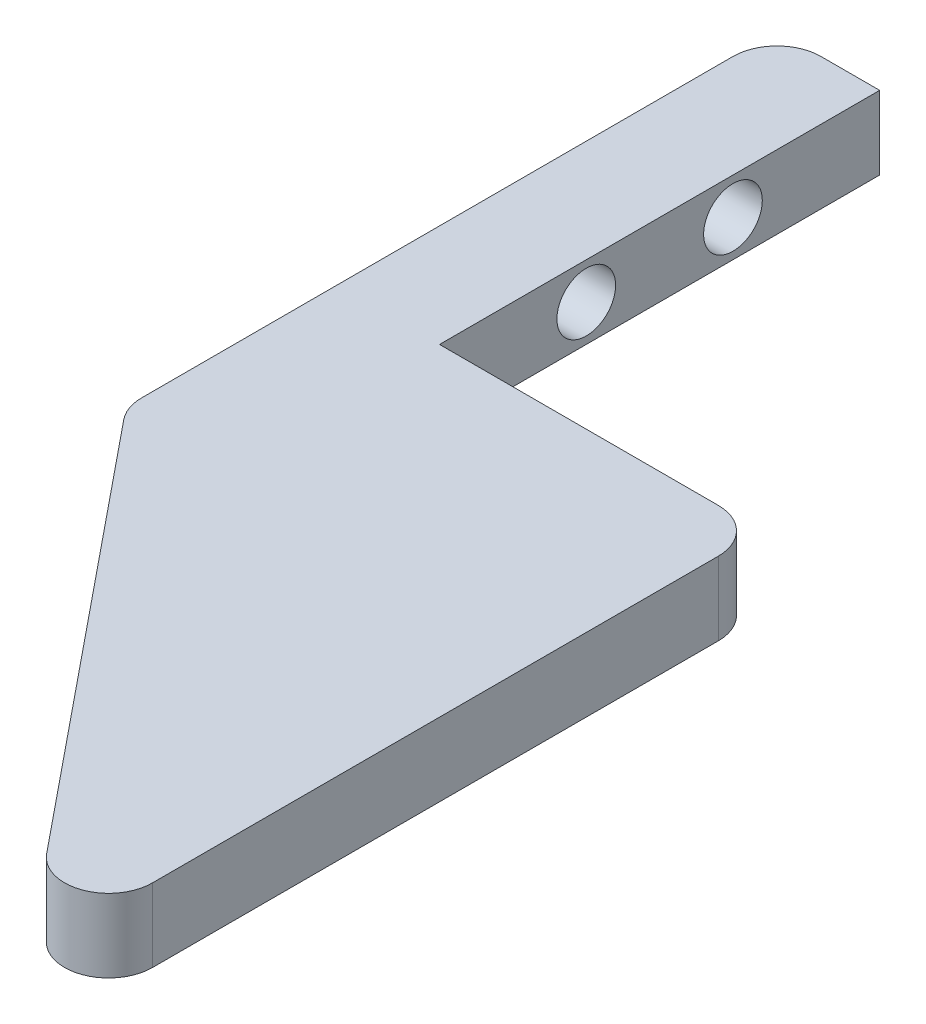
ISO-10303-21;
HEADER;
FILE_DESCRIPTION(('STEP AP214'),'2;1');
FILE_NAME('part.step','',(''),(''),'','','');
FILE_SCHEMA(('AUTOMOTIVE_DESIGN { 1 0 10303 214 1 1 1 1 }'));
ENDSEC;
DATA;
#1=APPLICATION_CONTEXT('core data for automotive mechanical design processes');
#2=APPLICATION_PROTOCOL_DEFINITION('international standard','automotive_design',2000,#1);
#3=PRODUCT_CONTEXT('',#1,'mechanical');
#4=PRODUCT('Part','Part','',(#3));
#5=PRODUCT_RELATED_PRODUCT_CATEGORY('part','',(#4));
#6=PRODUCT_DEFINITION_FORMATION('','',#4);
#7=PRODUCT_DEFINITION_CONTEXT('part definition',#1,'design');
#8=PRODUCT_DEFINITION('design','',#6,#7);
#9=PRODUCT_DEFINITION_SHAPE('','',#8);
#10=(LENGTH_UNIT() NAMED_UNIT(*) SI_UNIT(.MILLI.,.METRE.));
#11=(NAMED_UNIT(*) PLANE_ANGLE_UNIT() SI_UNIT($,.RADIAN.));
#12=(NAMED_UNIT(*) SI_UNIT($,.STERADIAN.) SOLID_ANGLE_UNIT());
#13=UNCERTAINTY_MEASURE_WITH_UNIT(LENGTH_MEASURE(1.E-05),#10,'distance_accuracy_value','');
#14=(GEOMETRIC_REPRESENTATION_CONTEXT(3) GLOBAL_UNCERTAINTY_ASSIGNED_CONTEXT((#13)) GLOBAL_UNIT_ASSIGNED_CONTEXT((#10,
#11,#12)) REPRESENTATION_CONTEXT('',''));
#15=CARTESIAN_POINT('',(0.,0.,0.));
#16=DIRECTION('',(0.,0.,1.));
#17=DIRECTION('',(1.,0.,0.));
#18=AXIS2_PLACEMENT_3D('',#15,#16,#17);
#19=CARTESIAN_POINT('',(-26.6350578217415,5.,-17.2767555448509));
#20=DIRECTION('',(0.,0.,1.));
#21=DIRECTION('',(1.,0.,0.));
#22=AXIS2_PLACEMENT_3D('',#19,#20,#21);
#23=PLANE('',#22);
#24=DIRECTION('',(-1.,0.,0.));
#25=VECTOR('',#24,1.);
#26=CARTESIAN_POINT('',(-26.6350578217415,0.,-17.2767555448509));
#27=LINE('',#26,#25);
#28=CARTESIAN_POINT('',(-19.6350578217415,0.,-17.2767555448509));
#29=VERTEX_POINT('',#28);
#30=CARTESIAN_POINT('',(-23.6350578217415,0.,-17.2767555448509));
#31=VERTEX_POINT('',#30);
#32=EDGE_CURVE('E150',#29,#31,#27,.T.);
#33=ORIENTED_EDGE('',*,*,#32,.T.);
#34=DIRECTION('',(0.,-1.,0.));
#35=VECTOR('',#34,1.);
#36=CARTESIAN_POINT('',(-23.6350578217415,5.,-17.2767555448509));
#37=LINE('',#36,#35);
#38=CARTESIAN_POINT('',(-23.6350578217415,5.,-17.2767555448509));
#39=VERTEX_POINT('',#38);
#40=EDGE_CURVE('E206',#31,#39,#37,.F.);
#41=ORIENTED_EDGE('',*,*,#40,.T.);
#42=DIRECTION('',(-1.,0.,0.));
#43=VECTOR('',#42,1.);
#44=CARTESIAN_POINT('',(-26.6350578217415,5.,-17.2767555448509));
#45=LINE('',#44,#43);
#46=CARTESIAN_POINT('',(-19.6350578217415,5.,-17.2767555448509));
#47=VERTEX_POINT('',#46);
#48=EDGE_CURVE('E169',#47,#39,#45,.T.);
#49=ORIENTED_EDGE('',*,*,#48,.F.);
#50=DIRECTION('',(0.,-1.,0.));
#51=VECTOR('',#50,1.);
#52=CARTESIAN_POINT('',(-19.6350578217415,5.,-17.2767555448509));
#53=LINE('',#52,#51);
#54=EDGE_CURVE('E139',#47,#29,#53,.T.);
#55=ORIENTED_EDGE('',*,*,#54,.T.);
#56=EDGE_LOOP('',(#33,#41,#49,#55));
#57=FACE_BOUND('',#56,.T.);
#58=ADVANCED_FACE('F37',(#57),#23,.F.);
#59=CARTESIAN_POINT('',(-26.6350578217415,5.,27.0940884058872));
#60=DIRECTION('',(1.,0.,0.));
#61=DIRECTION('',(0.,0.,-1.));
#62=AXIS2_PLACEMENT_3D('',#59,#60,#61);
#63=PLANE('',#62);
#64=CARTESIAN_POINT('',(-26.6350578217415,2.5,2.72324445514909));
#65=DIRECTION('',(1.,0.,0.));
#66=DIRECTION('',(0.,0.,-1.));
#67=AXIS2_PLACEMENT_3D('',#64,#65,#66);
#68=CIRCLE('',#67,2.);
#69=CARTESIAN_POINT('',(-26.6350578217415,2.5,0.72324445514909));
#70=VERTEX_POINT('',#69);
#71=EDGE_CURVE('E155',#70,#70,#68,.T.);
#72=ORIENTED_EDGE('',*,*,#71,.T.);
#73=EDGE_LOOP('',(#72));
#74=FACE_BOUND('',#73,.T.);
#75=CARTESIAN_POINT('',(-26.6350578217415,2.5,-7.27675554485091));
#76=DIRECTION('',(1.,0.,0.));
#77=DIRECTION('',(0.,0.,-1.));
#78=AXIS2_PLACEMENT_3D('',#75,#76,#77);
#79=CIRCLE('',#78,2.);
#80=CARTESIAN_POINT('',(-26.6350578217415,2.5,-9.27675554485091));
#81=VERTEX_POINT('',#80);
#82=EDGE_CURVE('E245',#81,#81,#79,.T.);
#83=ORIENTED_EDGE('',*,*,#82,.T.);
#84=EDGE_LOOP('',(#83));
#85=FACE_BOUND('',#84,.T.);
#86=DIRECTION('',(0.,0.,1.));
#87=VECTOR('',#86,1.);
#88=CARTESIAN_POINT('',(-26.6350578217415,0.,27.0940884058872));
#89=LINE('',#88,#87);
#90=CARTESIAN_POINT('',(-26.6350578217415,0.,-14.2767555448509));
#91=VERTEX_POINT('',#90);
#92=CARTESIAN_POINT('',(-26.6350578217415,0.,26.0275021133656));
#93=VERTEX_POINT('',#92);
#94=EDGE_CURVE('E154',#91,#93,#89,.T.);
#95=ORIENTED_EDGE('',*,*,#94,.T.);
#96=DIRECTION('',(0.,-1.,0.));
#97=VECTOR('',#96,1.);
#98=CARTESIAN_POINT('',(-26.6350578217415,5.,26.0275021133656));
#99=LINE('',#98,#97);
#100=CARTESIAN_POINT('',(-26.6350578217415,5.,26.0275021133656));
#101=VERTEX_POINT('',#100);
#102=EDGE_CURVE('E46',#93,#101,#99,.F.);
#103=ORIENTED_EDGE('',*,*,#102,.T.);
#104=DIRECTION('',(0.,0.,1.));
#105=VECTOR('',#104,1.);
#106=CARTESIAN_POINT('',(-26.6350578217415,5.,27.0940884058872));
#107=LINE('',#106,#105);
#108=CARTESIAN_POINT('',(-26.6350578217415,5.,-14.2767555448509));
#109=VERTEX_POINT('',#108);
#110=EDGE_CURVE('E235',#109,#101,#107,.T.);
#111=ORIENTED_EDGE('',*,*,#110,.F.);
#112=DIRECTION('',(0.,-1.,0.));
#113=VECTOR('',#112,1.);
#114=CARTESIAN_POINT('',(-26.6350578217415,5.,-14.2767555448509));
#115=LINE('',#114,#113);
#116=EDGE_CURVE('E202',#109,#91,#115,.T.);
#117=ORIENTED_EDGE('',*,*,#116,.T.);
#118=EDGE_LOOP('',(#95,#103,#111,#117));
#119=FACE_BOUND('',#118,.T.);
#120=ADVANCED_FACE('F272',(#74,#85,#119),#63,.F.);
#121=CARTESIAN_POINT('',(2.36494217825847,5.,62.7232444551491));
#122=DIRECTION('',(0.77556707499706,0.,-0.631265167881537));
#123=DIRECTION('',(-0.631265167881537,0.,-0.77556707499706));
#124=AXIS2_PLACEMENT_3D('',#121,#122,#123);
#125=PLANE('',#124);
#126=DIRECTION('',(0.631265167881537,0.,0.77556707499706));
#127=VECTOR('',#126,1.);
#128=CARTESIAN_POINT('',(2.36494217825847,5.,62.7232444551491));
#129=LINE('',#128,#127);
#130=CARTESIAN_POINT('',(-25.9617590467327,5.,27.9212976170102));
#131=VERTEX_POINT('',#130);
#132=CARTESIAN_POINT('',(-2.96175904673271,5.,56.1789041388386));
#133=VERTEX_POINT('',#132);
#134=EDGE_CURVE('E219',#131,#133,#129,.T.);
#135=ORIENTED_EDGE('',*,*,#134,.F.);
#136=DIRECTION('',(0.,-1.,0.));
#137=VECTOR('',#136,1.);
#138=CARTESIAN_POINT('',(-25.9617590467327,5.,27.9212976170102));
#139=LINE('',#138,#137);
#140=CARTESIAN_POINT('',(-25.9617590467327,0.,27.9212976170102));
#141=VERTEX_POINT('',#140);
#142=EDGE_CURVE('E209',#131,#141,#139,.T.);
#143=ORIENTED_EDGE('',*,*,#142,.T.);
#144=DIRECTION('',(0.631265167881537,0.,0.77556707499706));
#145=VECTOR('',#144,1.);
#146=CARTESIAN_POINT('',(2.36494217825847,0.,62.7232444551491));
#147=LINE('',#146,#145);
#148=CARTESIAN_POINT('',(-2.96175904673271,0.,56.1789041388386));
#149=VERTEX_POINT('',#148);
#150=EDGE_CURVE('E158',#141,#149,#147,.T.);
#151=ORIENTED_EDGE('',*,*,#150,.T.);
#152=DIRECTION('',(0.,-1.,0.));
#153=VECTOR('',#152,1.);
#154=CARTESIAN_POINT('',(-2.96175904673271,5.,56.1789041388386));
#155=LINE('',#154,#153);
#156=EDGE_CURVE('E178',#149,#133,#155,.F.);
#157=ORIENTED_EDGE('',*,*,#156,.T.);
#158=EDGE_LOOP('',(#135,#143,#151,#157));
#159=FACE_BOUND('',#158,.T.);
#160=ADVANCED_FACE('F218',(#159),#125,.F.);
#161=CARTESIAN_POINT('',(2.36494217825847,5.,12.7232444551491));
#162=DIRECTION('',(-1.,0.,0.));
#163=DIRECTION('',(0.,0.,1.));
#164=AXIS2_PLACEMENT_3D('',#161,#162,#163);
#165=PLANE('',#164);
#166=DIRECTION('',(0.,0.,-1.));
#167=VECTOR('',#166,1.);
#168=CARTESIAN_POINT('',(2.36494217825847,0.,12.7232444551491));
#169=LINE('',#168,#167);
#170=CARTESIAN_POINT('',(2.36494217825847,0.,54.285108635194));
#171=VERTEX_POINT('',#170);
#172=CARTESIAN_POINT('',(2.36494217825847,0.,15.7232444551491));
#173=VERTEX_POINT('',#172);
#174=EDGE_CURVE('E161',#171,#173,#169,.T.);
#175=ORIENTED_EDGE('',*,*,#174,.T.);
#176=DIRECTION('',(0.,-1.,0.));
#177=VECTOR('',#176,1.);
#178=CARTESIAN_POINT('',(2.36494217825847,5.,15.7232444551491));
#179=LINE('',#178,#177);
#180=CARTESIAN_POINT('',(2.36494217825847,5.,15.7232444551491));
#181=VERTEX_POINT('',#180);
#182=EDGE_CURVE('E194',#173,#181,#179,.F.);
#183=ORIENTED_EDGE('',*,*,#182,.T.);
#184=DIRECTION('',(0.,0.,-1.));
#185=VECTOR('',#184,1.);
#186=CARTESIAN_POINT('',(2.36494217825847,5.,12.7232444551491));
#187=LINE('',#186,#185);
#188=CARTESIAN_POINT('',(2.36494217825847,5.,54.285108635194));
#189=VERTEX_POINT('',#188);
#190=EDGE_CURVE('E128',#189,#181,#187,.T.);
#191=ORIENTED_EDGE('',*,*,#190,.F.);
#192=DIRECTION('',(0.,-1.,0.));
#193=VECTOR('',#192,1.);
#194=CARTESIAN_POINT('',(2.36494217825847,5.,54.285108635194));
#195=LINE('',#194,#193);
#196=EDGE_CURVE('E138',#189,#171,#195,.T.);
#197=ORIENTED_EDGE('',*,*,#196,.T.);
#198=EDGE_LOOP('',(#175,#183,#191,#197));
#199=FACE_BOUND('',#198,.T.);
#200=ADVANCED_FACE('F231',(#199),#165,.F.);
#201=CARTESIAN_POINT('',(-19.6350578217415,5.,12.7232444551491));
#202=DIRECTION('',(0.,0.,1.));
#203=DIRECTION('',(1.,0.,0.));
#204=AXIS2_PLACEMENT_3D('',#201,#202,#203);
#205=PLANE('',#204);
#206=DIRECTION('',(-1.,0.,0.));
#207=VECTOR('',#206,1.);
#208=CARTESIAN_POINT('',(-19.6350578217415,5.,12.7232444551491));
#209=LINE('',#208,#207);
#210=CARTESIAN_POINT('',(-0.635057821741534,5.,12.7232444551491));
#211=VERTEX_POINT('',#210);
#212=CARTESIAN_POINT('',(-19.6350578217415,5.,12.7232444551491));
#213=VERTEX_POINT('',#212);
#214=EDGE_CURVE('E114',#211,#213,#209,.T.);
#215=ORIENTED_EDGE('',*,*,#214,.F.);
#216=DIRECTION('',(0.,-1.,0.));
#217=VECTOR('',#216,1.);
#218=CARTESIAN_POINT('',(-0.635057821741534,5.,12.7232444551491));
#219=LINE('',#218,#217);
#220=CARTESIAN_POINT('',(-0.635057821741534,0.,12.7232444551491));
#221=VERTEX_POINT('',#220);
#222=EDGE_CURVE('E185',#211,#221,#219,.T.);
#223=ORIENTED_EDGE('',*,*,#222,.T.);
#224=DIRECTION('',(-1.,0.,0.));
#225=VECTOR('',#224,1.);
#226=CARTESIAN_POINT('',(-19.6350578217415,0.,12.7232444551491));
#227=LINE('',#226,#225);
#228=CARTESIAN_POINT('',(-19.6350578217415,0.,12.7232444551491));
#229=VERTEX_POINT('',#228);
#230=EDGE_CURVE('E134',#221,#229,#227,.T.);
#231=ORIENTED_EDGE('',*,*,#230,.T.);
#232=DIRECTION('',(0.,-1.,0.));
#233=VECTOR('',#232,1.);
#234=CARTESIAN_POINT('',(-19.6350578217415,5.,12.7232444551491));
#235=LINE('',#234,#233);
#236=EDGE_CURVE('E131',#213,#229,#235,.T.);
#237=ORIENTED_EDGE('',*,*,#236,.F.);
#238=EDGE_LOOP('',(#215,#223,#231,#237));
#239=FACE_BOUND('',#238,.T.);
#240=ADVANCED_FACE('F132',(#239),#205,.F.);
#241=CARTESIAN_POINT('',(-19.6350578217415,5.,-17.2767555448509));
#242=DIRECTION('',(-1.,0.,0.));
#243=DIRECTION('',(0.,0.,1.));
#244=AXIS2_PLACEMENT_3D('',#241,#242,#243);
#245=PLANE('',#244);
#246=CARTESIAN_POINT('',(-19.6350578217415,2.5,2.72324445514909));
#247=DIRECTION('',(1.,0.,0.));
#248=DIRECTION('',(0.,0.,-1.));
#249=AXIS2_PLACEMENT_3D('',#246,#247,#248);
#250=CIRCLE('',#249,2.);
#251=CARTESIAN_POINT('',(-19.6350578217415,2.5,0.72324445514909));
#252=VERTEX_POINT('',#251);
#253=EDGE_CURVE('E249',#252,#252,#250,.T.);
#254=ORIENTED_EDGE('',*,*,#253,.F.);
#255=EDGE_LOOP('',(#254));
#256=FACE_BOUND('',#255,.T.);
#257=CARTESIAN_POINT('',(-19.6350578217415,2.5,-7.27675554485091));
#258=DIRECTION('',(1.,0.,0.));
#259=DIRECTION('',(0.,0.,-1.));
#260=AXIS2_PLACEMENT_3D('',#257,#258,#259);
#261=CIRCLE('',#260,2.);
#262=CARTESIAN_POINT('',(-19.6350578217415,2.5,-9.27675554485091));
#263=VERTEX_POINT('',#262);
#264=EDGE_CURVE('E250',#263,#263,#261,.T.);
#265=ORIENTED_EDGE('',*,*,#264,.F.);
#266=EDGE_LOOP('',(#265));
#267=FACE_BOUND('',#266,.T.);
#268=DIRECTION('',(0.,0.,-1.));
#269=VECTOR('',#268,1.);
#270=CARTESIAN_POINT('',(-19.6350578217415,0.,-17.2767555448509));
#271=LINE('',#270,#269);
#272=EDGE_CURVE('E167',#229,#29,#271,.T.);
#273=ORIENTED_EDGE('',*,*,#272,.T.);
#274=ORIENTED_EDGE('',*,*,#54,.F.);
#275=DIRECTION('',(0.,0.,-1.));
#276=VECTOR('',#275,1.);
#277=CARTESIAN_POINT('',(-19.6350578217415,5.,-17.2767555448509));
#278=LINE('',#277,#276);
#279=EDGE_CURVE('E119',#213,#47,#278,.T.);
#280=ORIENTED_EDGE('',*,*,#279,.F.);
#281=ORIENTED_EDGE('',*,*,#236,.T.);
#282=EDGE_LOOP('',(#273,#274,#280,#281));
#283=FACE_BOUND('',#282,.T.);
#284=ADVANCED_FACE('F141',(#256,#267,#283),#245,.F.);
#285=CARTESIAN_POINT('',(0.,5.,0.));
#286=DIRECTION('',(0.,-1.,0.));
#287=DIRECTION('',(0.,0.,-1.));
#288=AXIS2_PLACEMENT_3D('',#285,#286,#287);
#289=PLANE('',#288);
#290=ORIENTED_EDGE('',*,*,#110,.T.);
#291=CARTESIAN_POINT('',(-23.6350578217415,5.,26.0275021133656));
#292=DIRECTION('',(0.,-1.,0.));
#293=DIRECTION('',(0.,0.,-1.));
#294=AXIS2_PLACEMENT_3D('',#291,#292,#293);
#295=CIRCLE('',#294,3.);
#296=EDGE_CURVE('E11',#101,#131,#295,.F.);
#297=ORIENTED_EDGE('',*,*,#296,.T.);
#298=ORIENTED_EDGE('',*,*,#134,.T.);
#299=CARTESIAN_POINT('',(-0.63505782174153,5.,54.285108635194));
#300=DIRECTION('',(0.,-1.,0.));
#301=DIRECTION('',(0.,0.,-1.));
#302=AXIS2_PLACEMENT_3D('',#299,#300,#301);
#303=CIRCLE('',#302,3.);
#304=EDGE_CURVE('E182',#133,#189,#303,.F.);
#305=ORIENTED_EDGE('',*,*,#304,.T.);
#306=ORIENTED_EDGE('',*,*,#190,.T.);
#307=CARTESIAN_POINT('',(-0.635057821741534,5.,15.7232444551491));
#308=DIRECTION('',(0.,-1.,0.));
#309=DIRECTION('',(0.,0.,-1.));
#310=AXIS2_PLACEMENT_3D('',#307,#308,#309);
#311=CIRCLE('',#310,3.);
#312=EDGE_CURVE('E123',#181,#211,#311,.F.);
#313=ORIENTED_EDGE('',*,*,#312,.T.);
#314=ORIENTED_EDGE('',*,*,#214,.T.);
#315=ORIENTED_EDGE('',*,*,#279,.T.);
#316=ORIENTED_EDGE('',*,*,#48,.T.);
#317=CARTESIAN_POINT('',(-23.6350578217415,5.,-14.2767555448509));
#318=DIRECTION('',(0.,-1.,0.));
#319=DIRECTION('',(0.,0.,-1.));
#320=AXIS2_PLACEMENT_3D('',#317,#318,#319);
#321=CIRCLE('',#320,3.);
#322=EDGE_CURVE('E197',#39,#109,#321,.F.);
#323=ORIENTED_EDGE('',*,*,#322,.T.);
#324=EDGE_LOOP('',(#290,#297,#298,#305,#306,#313,#314,#315,#316,#323));
#325=FACE_BOUND('',#324,.T.);
#326=ADVANCED_FACE('F116',(#325),#289,.F.);
#327=CARTESIAN_POINT('',(0.,0.,0.));
#328=DIRECTION('',(0.,-1.,0.));
#329=DIRECTION('',(0.,0.,-1.));
#330=AXIS2_PLACEMENT_3D('',#327,#328,#329);
#331=PLANE('',#330);
#332=ORIENTED_EDGE('',*,*,#150,.F.);
#333=CARTESIAN_POINT('',(-23.6350578217415,0.,26.0275021133656));
#334=DIRECTION('',(0.,-1.,0.));
#335=DIRECTION('',(0.,0.,-1.));
#336=AXIS2_PLACEMENT_3D('',#333,#334,#335);
#337=CIRCLE('',#336,3.);
#338=EDGE_CURVE('E60',#141,#93,#337,.T.);
#339=ORIENTED_EDGE('',*,*,#338,.T.);
#340=ORIENTED_EDGE('',*,*,#94,.F.);
#341=CARTESIAN_POINT('',(-23.6350578217415,0.,-14.2767555448509));
#342=DIRECTION('',(0.,-1.,0.));
#343=DIRECTION('',(0.,0.,-1.));
#344=AXIS2_PLACEMENT_3D('',#341,#342,#343);
#345=CIRCLE('',#344,3.);
#346=EDGE_CURVE('E188',#91,#31,#345,.T.);
#347=ORIENTED_EDGE('',*,*,#346,.T.);
#348=ORIENTED_EDGE('',*,*,#32,.F.);
#349=ORIENTED_EDGE('',*,*,#272,.F.);
#350=ORIENTED_EDGE('',*,*,#230,.F.);
#351=CARTESIAN_POINT('',(-0.635057821741534,0.,15.7232444551491));
#352=DIRECTION('',(0.,-1.,0.));
#353=DIRECTION('',(0.,0.,-1.));
#354=AXIS2_PLACEMENT_3D('',#351,#352,#353);
#355=CIRCLE('',#354,3.);
#356=EDGE_CURVE('E191',#221,#173,#355,.T.);
#357=ORIENTED_EDGE('',*,*,#356,.T.);
#358=ORIENTED_EDGE('',*,*,#174,.F.);
#359=CARTESIAN_POINT('',(-0.63505782174153,0.,54.285108635194));
#360=DIRECTION('',(0.,-1.,0.));
#361=DIRECTION('',(0.,0.,-1.));
#362=AXIS2_PLACEMENT_3D('',#359,#360,#361);
#363=CIRCLE('',#362,3.);
#364=EDGE_CURVE('E174',#171,#149,#363,.T.);
#365=ORIENTED_EDGE('',*,*,#364,.T.);
#366=EDGE_LOOP('',(#332,#339,#340,#347,#348,#349,#350,#357,#358,#365));
#367=FACE_BOUND('',#366,.T.);
#368=ADVANCED_FACE('F222',(#367),#331,.T.);
#369=CARTESIAN_POINT('',(-39.6350578217415,2.5,-7.27675554485091));
#370=DIRECTION('',(1.,0.,0.));
#371=DIRECTION('',(0.,0.,-1.));
#372=AXIS2_PLACEMENT_3D('',#369,#370,#371);
#373=CYLINDRICAL_SURFACE('',#372,2.);
#374=ORIENTED_EDGE('',*,*,#264,.T.);
#375=EDGE_LOOP('',(#374));
#376=FACE_BOUND('',#375,.T.);
#377=ORIENTED_EDGE('',*,*,#82,.F.);
#378=EDGE_LOOP('',(#377));
#379=FACE_BOUND('',#378,.T.);
#380=ADVANCED_FACE('F266',(#376,#379),#373,.F.);
#381=CARTESIAN_POINT('',(-39.6350578217415,2.5,2.72324445514909));
#382=DIRECTION('',(1.,0.,0.));
#383=DIRECTION('',(0.,0.,-1.));
#384=AXIS2_PLACEMENT_3D('',#381,#382,#383);
#385=CYLINDRICAL_SURFACE('',#384,2.);
#386=ORIENTED_EDGE('',*,*,#253,.T.);
#387=EDGE_LOOP('',(#386));
#388=FACE_BOUND('',#387,.T.);
#389=ORIENTED_EDGE('',*,*,#71,.F.);
#390=EDGE_LOOP('',(#389));
#391=FACE_BOUND('',#390,.T.);
#392=ADVANCED_FACE('F258',(#388,#391),#385,.F.);
#393=CARTESIAN_POINT('',(-0.63505782174153,5.,54.285108635194));
#394=DIRECTION('',(0.,-1.,0.));
#395=DIRECTION('',(0.,0.,-1.));
#396=AXIS2_PLACEMENT_3D('',#393,#394,#395);
#397=CYLINDRICAL_SURFACE('',#396,3.);
#398=ORIENTED_EDGE('',*,*,#304,.F.);
#399=ORIENTED_EDGE('',*,*,#156,.F.);
#400=ORIENTED_EDGE('',*,*,#364,.F.);
#401=ORIENTED_EDGE('',*,*,#196,.F.);
#402=EDGE_LOOP('',(#398,#399,#400,#401));
#403=FACE_BOUND('',#402,.T.);
#404=ADVANCED_FACE('F228',(#403),#397,.T.);
#405=CARTESIAN_POINT('',(-0.635057821741534,5.,15.7232444551491));
#406=DIRECTION('',(0.,-1.,0.));
#407=DIRECTION('',(0.,0.,-1.));
#408=AXIS2_PLACEMENT_3D('',#405,#406,#407);
#409=CYLINDRICAL_SURFACE('',#408,3.);
#410=ORIENTED_EDGE('',*,*,#312,.F.);
#411=ORIENTED_EDGE('',*,*,#182,.F.);
#412=ORIENTED_EDGE('',*,*,#356,.F.);
#413=ORIENTED_EDGE('',*,*,#222,.F.);
#414=EDGE_LOOP('',(#410,#411,#412,#413));
#415=FACE_BOUND('',#414,.T.);
#416=ADVANCED_FACE('F291',(#415),#409,.T.);
#417=CARTESIAN_POINT('',(-23.6350578217415,5.,-14.2767555448509));
#418=DIRECTION('',(0.,-1.,0.));
#419=DIRECTION('',(0.,0.,-1.));
#420=AXIS2_PLACEMENT_3D('',#417,#418,#419);
#421=CYLINDRICAL_SURFACE('',#420,3.);
#422=ORIENTED_EDGE('',*,*,#322,.F.);
#423=ORIENTED_EDGE('',*,*,#40,.F.);
#424=ORIENTED_EDGE('',*,*,#346,.F.);
#425=ORIENTED_EDGE('',*,*,#116,.F.);
#426=EDGE_LOOP('',(#422,#423,#424,#425));
#427=FACE_BOUND('',#426,.T.);
#428=ADVANCED_FACE('F279',(#427),#421,.T.);
#429=CARTESIAN_POINT('',(-23.6350578217415,5.,26.0275021133656));
#430=DIRECTION('',(0.,-1.,0.));
#431=DIRECTION('',(0.,0.,-1.));
#432=AXIS2_PLACEMENT_3D('',#429,#430,#431);
#433=CYLINDRICAL_SURFACE('',#432,3.);
#434=ORIENTED_EDGE('',*,*,#296,.F.);
#435=ORIENTED_EDGE('',*,*,#102,.F.);
#436=ORIENTED_EDGE('',*,*,#338,.F.);
#437=ORIENTED_EDGE('',*,*,#142,.F.);
#438=EDGE_LOOP('',(#434,#435,#436,#437));
#439=FACE_BOUND('',#438,.T.);
#440=ADVANCED_FACE('F39',(#439),#433,.T.);
#441=CLOSED_SHELL('',(#58,#120,#160,#200,#240,#284,#326,#368,#380,#392,#404,#416,#428,#440));
#442=MANIFOLD_SOLID_BREP('B2',#441);
#443=ADVANCED_BREP_SHAPE_REPRESENTATION('',(#18,#442),#14);
#444=SHAPE_DEFINITION_REPRESENTATION(#9,#443);
ENDSEC;
END-ISO-10303-21;
